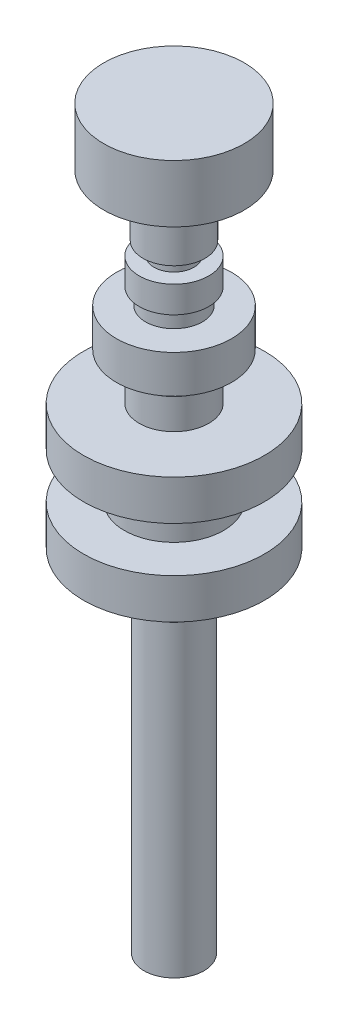
ISO-10303-21;
HEADER;
FILE_DESCRIPTION(('STEP AP214'),'2;1');
FILE_NAME('part.step','',(''),(''),'','','');
FILE_SCHEMA(('AUTOMOTIVE_DESIGN { 1 0 10303 214 1 1 1 1 }'));
ENDSEC;
DATA;
#1=APPLICATION_CONTEXT('core data for automotive mechanical design processes');
#2=APPLICATION_PROTOCOL_DEFINITION('international standard','automotive_design',2000,#1);
#3=PRODUCT_CONTEXT('',#1,'mechanical');
#4=PRODUCT('Part','Part','',(#3));
#5=PRODUCT_RELATED_PRODUCT_CATEGORY('part','',(#4));
#6=PRODUCT_DEFINITION_FORMATION('','',#4);
#7=PRODUCT_DEFINITION_CONTEXT('part definition',#1,'design');
#8=PRODUCT_DEFINITION('design','',#6,#7);
#9=PRODUCT_DEFINITION_SHAPE('','',#8);
#10=(LENGTH_UNIT() NAMED_UNIT(*) SI_UNIT(.MILLI.,.METRE.));
#11=(NAMED_UNIT(*) PLANE_ANGLE_UNIT() SI_UNIT($,.RADIAN.));
#12=(NAMED_UNIT(*) SI_UNIT($,.STERADIAN.) SOLID_ANGLE_UNIT());
#13=UNCERTAINTY_MEASURE_WITH_UNIT(LENGTH_MEASURE(1.E-05),#10,'distance_accuracy_value','');
#14=(GEOMETRIC_REPRESENTATION_CONTEXT(3) GLOBAL_UNCERTAINTY_ASSIGNED_CONTEXT((#13)) GLOBAL_UNIT_ASSIGNED_CONTEXT((#10,
#11,#12)) REPRESENTATION_CONTEXT('',''));
#15=CARTESIAN_POINT('',(0.,0.,0.));
#16=DIRECTION('',(0.,0.,1.));
#17=DIRECTION('',(1.,0.,0.));
#18=AXIS2_PLACEMENT_3D('',#15,#16,#17);
#19=CARTESIAN_POINT('',(0.,0.,0.));
#20=DIRECTION('',(0.,-1.,0.));
#21=DIRECTION('',(0.,0.,-1.));
#22=AXIS2_PLACEMENT_3D('',#19,#20,#21);
#23=PLANE('',#22);
#24=CARTESIAN_POINT('',(0.,0.,0.));
#25=DIRECTION('',(0.,-1.,0.));
#26=DIRECTION('',(0.,0.,-1.));
#27=AXIS2_PLACEMENT_3D('',#24,#25,#26);
#28=CIRCLE('',#27,4.75);
#29=CARTESIAN_POINT('',(0.,0.,-4.75));
#30=VERTEX_POINT('',#29);
#31=EDGE_CURVE('E10',#30,#30,#28,.T.);
#32=ORIENTED_EDGE('',*,*,#31,.T.);
#33=EDGE_LOOP('',(#32));
#34=FACE_BOUND('',#33,.T.);
#35=ADVANCED_FACE('F30',(#34),#23,.T.);
#36=CARTESIAN_POINT('',(0.,0.,0.));
#37=DIRECTION('',(0.,-1.,0.));
#38=DIRECTION('',(0.,0.,-1.));
#39=AXIS2_PLACEMENT_3D('',#36,#37,#38);
#40=CYLINDRICAL_SURFACE('',#39,4.75);
#41=CARTESIAN_POINT('',(0.,49.8,0.));
#42=DIRECTION('',(0.,-1.,0.));
#43=DIRECTION('',(0.,0.,-1.));
#44=AXIS2_PLACEMENT_3D('',#41,#42,#43);
#45=CIRCLE('',#44,4.75);
#46=CARTESIAN_POINT('',(0.,49.8,-4.75));
#47=VERTEX_POINT('',#46);
#48=EDGE_CURVE('E36',#47,#47,#45,.T.);
#49=ORIENTED_EDGE('',*,*,#48,.T.);
#50=EDGE_LOOP('',(#49));
#51=FACE_BOUND('',#50,.T.);
#52=ORIENTED_EDGE('',*,*,#31,.F.);
#53=EDGE_LOOP('',(#52));
#54=FACE_BOUND('',#53,.T.);
#55=ADVANCED_FACE('F128',(#51,#54),#40,.T.);
#56=CARTESIAN_POINT('',(4.75,49.8,0.));
#57=DIRECTION('',(0.,-1.,0.));
#58=DIRECTION('',(0.,0.,-1.));
#59=AXIS2_PLACEMENT_3D('',#56,#57,#58);
#60=PLANE('',#59);
#61=CARTESIAN_POINT('',(0.,49.8,0.));
#62=DIRECTION('',(0.,-1.,0.));
#63=DIRECTION('',(0.,0.,-1.));
#64=AXIS2_PLACEMENT_3D('',#61,#62,#63);
#65=CIRCLE('',#64,6.3);
#66=CARTESIAN_POINT('',(0.,49.8,-6.3));
#67=VERTEX_POINT('',#66);
#68=EDGE_CURVE('E40',#67,#67,#65,.T.);
#69=ORIENTED_EDGE('',*,*,#68,.T.);
#70=EDGE_LOOP('',(#69));
#71=FACE_BOUND('',#70,.T.);
#72=ORIENTED_EDGE('',*,*,#48,.F.);
#73=EDGE_LOOP('',(#72));
#74=FACE_BOUND('',#73,.T.);
#75=ADVANCED_FACE('F132',(#71,#74),#60,.T.);
#76=CARTESIAN_POINT('',(0.,0.,0.));
#77=DIRECTION('',(0.,-1.,0.));
#78=DIRECTION('',(0.,0.,-1.));
#79=AXIS2_PLACEMENT_3D('',#76,#77,#78);
#80=CYLINDRICAL_SURFACE('',#79,6.3);
#81=CARTESIAN_POINT('',(0.,55.5,0.));
#82=DIRECTION('',(0.,-1.,0.));
#83=DIRECTION('',(0.,0.,-1.));
#84=AXIS2_PLACEMENT_3D('',#81,#82,#83);
#85=CIRCLE('',#84,6.3);
#86=CARTESIAN_POINT('',(0.,55.5,-6.3));
#87=VERTEX_POINT('',#86);
#88=EDGE_CURVE('E44',#87,#87,#85,.T.);
#89=ORIENTED_EDGE('',*,*,#88,.T.);
#90=EDGE_LOOP('',(#89));
#91=FACE_BOUND('',#90,.T.);
#92=ORIENTED_EDGE('',*,*,#68,.F.);
#93=EDGE_LOOP('',(#92));
#94=FACE_BOUND('',#93,.T.);
#95=ADVANCED_FACE('F136',(#91,#94),#80,.T.);
#96=CARTESIAN_POINT('',(6.3,55.5,0.));
#97=DIRECTION('',(0.,-1.,0.));
#98=DIRECTION('',(0.,0.,-1.));
#99=AXIS2_PLACEMENT_3D('',#96,#97,#98);
#100=PLANE('',#99);
#101=CARTESIAN_POINT('',(0.,55.5,0.));
#102=DIRECTION('',(0.,-1.,0.));
#103=DIRECTION('',(0.,0.,-1.));
#104=AXIS2_PLACEMENT_3D('',#101,#102,#103);
#105=CIRCLE('',#104,14.3);
#106=CARTESIAN_POINT('',(0.,55.5,-14.3));
#107=VERTEX_POINT('',#106);
#108=EDGE_CURVE('E49',#107,#107,#105,.T.);
#109=ORIENTED_EDGE('',*,*,#108,.T.);
#110=EDGE_LOOP('',(#109));
#111=FACE_BOUND('',#110,.T.);
#112=ORIENTED_EDGE('',*,*,#88,.F.);
#113=EDGE_LOOP('',(#112));
#114=FACE_BOUND('',#113,.T.);
#115=ADVANCED_FACE('F143',(#111,#114),#100,.T.);
#116=CARTESIAN_POINT('',(0.,0.,0.));
#117=DIRECTION('',(0.,-1.,0.));
#118=DIRECTION('',(0.,0.,-1.));
#119=AXIS2_PLACEMENT_3D('',#116,#117,#118);
#120=CYLINDRICAL_SURFACE('',#119,14.3);
#121=CARTESIAN_POINT('',(0.,61.85,0.));
#122=DIRECTION('',(0.,-1.,0.));
#123=DIRECTION('',(0.,0.,-1.));
#124=AXIS2_PLACEMENT_3D('',#121,#122,#123);
#125=CIRCLE('',#124,14.3);
#126=CARTESIAN_POINT('',(0.,61.85,-14.3));
#127=VERTEX_POINT('',#126);
#128=EDGE_CURVE('E52',#127,#127,#125,.T.);
#129=ORIENTED_EDGE('',*,*,#128,.T.);
#130=EDGE_LOOP('',(#129));
#131=FACE_BOUND('',#130,.T.);
#132=ORIENTED_EDGE('',*,*,#108,.F.);
#133=EDGE_LOOP('',(#132));
#134=FACE_BOUND('',#133,.T.);
#135=ADVANCED_FACE('F147',(#131,#134),#120,.T.);
#136=CARTESIAN_POINT('',(14.3,61.85,0.));
#137=DIRECTION('',(0.,1.,0.));
#138=DIRECTION('',(0.,0.,1.));
#139=AXIS2_PLACEMENT_3D('',#136,#137,#138);
#140=PLANE('',#139);
#141=CARTESIAN_POINT('',(0.,61.85,0.));
#142=DIRECTION('',(0.,-1.,0.));
#143=DIRECTION('',(0.,0.,-1.));
#144=AXIS2_PLACEMENT_3D('',#141,#142,#143);
#145=CIRCLE('',#144,7.85);
#146=CARTESIAN_POINT('',(0.,61.85,-7.85));
#147=VERTEX_POINT('',#146);
#148=EDGE_CURVE('E55',#147,#147,#145,.T.);
#149=ORIENTED_EDGE('',*,*,#148,.T.);
#150=EDGE_LOOP('',(#149));
#151=FACE_BOUND('',#150,.T.);
#152=ORIENTED_EDGE('',*,*,#128,.F.);
#153=EDGE_LOOP('',(#152));
#154=FACE_BOUND('',#153,.T.);
#155=ADVANCED_FACE('F151',(#151,#154),#140,.T.);
#156=CARTESIAN_POINT('',(0.,0.,0.));
#157=DIRECTION('',(0.,-1.,0.));
#158=DIRECTION('',(0.,0.,-1.));
#159=AXIS2_PLACEMENT_3D('',#156,#157,#158);
#160=CYLINDRICAL_SURFACE('',#159,7.85);
#161=CARTESIAN_POINT('',(0.,69.,0.));
#162=DIRECTION('',(0.,-1.,0.));
#163=DIRECTION('',(0.,0.,-1.));
#164=AXIS2_PLACEMENT_3D('',#161,#162,#163);
#165=CIRCLE('',#164,7.85);
#166=CARTESIAN_POINT('',(0.,69.,-7.85));
#167=VERTEX_POINT('',#166);
#168=EDGE_CURVE('E58',#167,#167,#165,.T.);
#169=ORIENTED_EDGE('',*,*,#168,.T.);
#170=EDGE_LOOP('',(#169));
#171=FACE_BOUND('',#170,.T.);
#172=ORIENTED_EDGE('',*,*,#148,.F.);
#173=EDGE_LOOP('',(#172));
#174=FACE_BOUND('',#173,.T.);
#175=ADVANCED_FACE('F155',(#171,#174),#160,.T.);
#176=CARTESIAN_POINT('',(7.85,69.,0.));
#177=DIRECTION('',(0.,-1.,0.));
#178=DIRECTION('',(0.,0.,-1.));
#179=AXIS2_PLACEMENT_3D('',#176,#177,#178);
#180=PLANE('',#179);
#181=CARTESIAN_POINT('',(0.,69.,0.));
#182=DIRECTION('',(0.,-1.,0.));
#183=DIRECTION('',(0.,0.,-1.));
#184=AXIS2_PLACEMENT_3D('',#181,#182,#183);
#185=CIRCLE('',#184,14.3);
#186=CARTESIAN_POINT('',(0.,69.,-14.3));
#187=VERTEX_POINT('',#186);
#188=EDGE_CURVE('E61',#187,#187,#185,.T.);
#189=ORIENTED_EDGE('',*,*,#188,.T.);
#190=EDGE_LOOP('',(#189));
#191=FACE_BOUND('',#190,.T.);
#192=ORIENTED_EDGE('',*,*,#168,.F.);
#193=EDGE_LOOP('',(#192));
#194=FACE_BOUND('',#193,.T.);
#195=ADVANCED_FACE('F159',(#191,#194),#180,.T.);
#196=CARTESIAN_POINT('',(0.,0.,0.));
#197=DIRECTION('',(0.,-1.,0.));
#198=DIRECTION('',(0.,0.,-1.));
#199=AXIS2_PLACEMENT_3D('',#196,#197,#198);
#200=CYLINDRICAL_SURFACE('',#199,14.3);
#201=CARTESIAN_POINT('',(0.,75.35,0.));
#202=DIRECTION('',(0.,-1.,0.));
#203=DIRECTION('',(0.,0.,-1.));
#204=AXIS2_PLACEMENT_3D('',#201,#202,#203);
#205=CIRCLE('',#204,14.3);
#206=CARTESIAN_POINT('',(0.,75.35,-14.3));
#207=VERTEX_POINT('',#206);
#208=EDGE_CURVE('E64',#207,#207,#205,.T.);
#209=ORIENTED_EDGE('',*,*,#208,.T.);
#210=EDGE_LOOP('',(#209));
#211=FACE_BOUND('',#210,.T.);
#212=ORIENTED_EDGE('',*,*,#188,.F.);
#213=EDGE_LOOP('',(#212));
#214=FACE_BOUND('',#213,.T.);
#215=ADVANCED_FACE('F163',(#211,#214),#200,.T.);
#216=CARTESIAN_POINT('',(14.3,75.35,0.));
#217=DIRECTION('',(0.,1.,0.));
#218=DIRECTION('',(0.,0.,1.));
#219=AXIS2_PLACEMENT_3D('',#216,#217,#218);
#220=PLANE('',#219);
#221=CARTESIAN_POINT('',(0.,75.35,0.));
#222=DIRECTION('',(0.,-1.,0.));
#223=DIRECTION('',(0.,0.,-1.));
#224=AXIS2_PLACEMENT_3D('',#221,#222,#223);
#225=CIRCLE('',#224,5.50000000000001);
#226=CARTESIAN_POINT('',(0.,75.35,-5.50000000000001));
#227=VERTEX_POINT('',#226);
#228=EDGE_CURVE('E67',#227,#227,#225,.T.);
#229=ORIENTED_EDGE('',*,*,#228,.T.);
#230=EDGE_LOOP('',(#229));
#231=FACE_BOUND('',#230,.T.);
#232=ORIENTED_EDGE('',*,*,#208,.F.);
#233=EDGE_LOOP('',(#232));
#234=FACE_BOUND('',#233,.T.);
#235=ADVANCED_FACE('F167',(#231,#234),#220,.T.);
#236=CARTESIAN_POINT('',(0.,0.,0.));
#237=DIRECTION('',(0.,-1.,0.));
#238=DIRECTION('',(0.,0.,-1.));
#239=AXIS2_PLACEMENT_3D('',#236,#237,#238);
#240=CYLINDRICAL_SURFACE('',#239,5.50000000000001);
#241=CARTESIAN_POINT('',(0.,80.15,0.));
#242=DIRECTION('',(0.,-1.,0.));
#243=DIRECTION('',(0.,0.,-1.));
#244=AXIS2_PLACEMENT_3D('',#241,#242,#243);
#245=CIRCLE('',#244,5.50000000000001);
#246=CARTESIAN_POINT('',(0.,80.15,-5.50000000000001));
#247=VERTEX_POINT('',#246);
#248=EDGE_CURVE('E70',#247,#247,#245,.T.);
#249=ORIENTED_EDGE('',*,*,#248,.T.);
#250=EDGE_LOOP('',(#249));
#251=FACE_BOUND('',#250,.T.);
#252=ORIENTED_EDGE('',*,*,#228,.F.);
#253=EDGE_LOOP('',(#252));
#254=FACE_BOUND('',#253,.T.);
#255=ADVANCED_FACE('F171',(#251,#254),#240,.T.);
#256=CARTESIAN_POINT('',(5.50000000000001,80.15,0.));
#257=DIRECTION('',(0.,1.,0.));
#258=DIRECTION('',(0.,0.,1.));
#259=AXIS2_PLACEMENT_3D('',#256,#257,#258);
#260=PLANE('',#259);
#261=CARTESIAN_POINT('',(0.,80.15,0.));
#262=DIRECTION('',(0.,-1.,0.));
#263=DIRECTION('',(0.,0.,-1.));
#264=AXIS2_PLACEMENT_3D('',#261,#262,#263);
#265=CIRCLE('',#264,4.5);
#266=CARTESIAN_POINT('',(0.,80.15,-4.5));
#267=VERTEX_POINT('',#266);
#268=EDGE_CURVE('E73',#267,#267,#265,.T.);
#269=ORIENTED_EDGE('',*,*,#268,.T.);
#270=EDGE_LOOP('',(#269));
#271=FACE_BOUND('',#270,.T.);
#272=ORIENTED_EDGE('',*,*,#248,.F.);
#273=EDGE_LOOP('',(#272));
#274=FACE_BOUND('',#273,.T.);
#275=ADVANCED_FACE('F175',(#271,#274),#260,.T.);
#276=CARTESIAN_POINT('',(0.,0.,0.));
#277=DIRECTION('',(0.,-1.,0.));
#278=DIRECTION('',(0.,0.,-1.));
#279=AXIS2_PLACEMENT_3D('',#276,#277,#278);
#280=CYLINDRICAL_SURFACE('',#279,4.5);
#281=CARTESIAN_POINT('',(0.,82.75,0.));
#282=DIRECTION('',(0.,-1.,0.));
#283=DIRECTION('',(0.,0.,-1.));
#284=AXIS2_PLACEMENT_3D('',#281,#282,#283);
#285=CIRCLE('',#284,4.5);
#286=CARTESIAN_POINT('',(0.,82.75,-4.5));
#287=VERTEX_POINT('',#286);
#288=EDGE_CURVE('E76',#287,#287,#285,.T.);
#289=ORIENTED_EDGE('',*,*,#288,.T.);
#290=EDGE_LOOP('',(#289));
#291=FACE_BOUND('',#290,.T.);
#292=ORIENTED_EDGE('',*,*,#268,.F.);
#293=EDGE_LOOP('',(#292));
#294=FACE_BOUND('',#293,.T.);
#295=ADVANCED_FACE('F179',(#291,#294),#280,.T.);
#296=CARTESIAN_POINT('',(4.5,82.75,0.));
#297=DIRECTION('',(0.,-1.,0.));
#298=DIRECTION('',(0.,0.,-1.));
#299=AXIS2_PLACEMENT_3D('',#296,#297,#298);
#300=PLANE('',#299);
#301=CARTESIAN_POINT('',(0.,82.75,0.));
#302=DIRECTION('',(0.,-1.,0.));
#303=DIRECTION('',(0.,0.,-1.));
#304=AXIS2_PLACEMENT_3D('',#301,#302,#303);
#305=CIRCLE('',#304,9.1);
#306=CARTESIAN_POINT('',(0.,82.75,-9.1));
#307=VERTEX_POINT('',#306);
#308=EDGE_CURVE('E79',#307,#307,#305,.T.);
#309=ORIENTED_EDGE('',*,*,#308,.T.);
#310=EDGE_LOOP('',(#309));
#311=FACE_BOUND('',#310,.T.);
#312=ORIENTED_EDGE('',*,*,#288,.F.);
#313=EDGE_LOOP('',(#312));
#314=FACE_BOUND('',#313,.T.);
#315=ADVANCED_FACE('F183',(#311,#314),#300,.T.);
#316=CARTESIAN_POINT('',(0.,0.,0.));
#317=DIRECTION('',(0.,-1.,0.));
#318=DIRECTION('',(0.,0.,-1.));
#319=AXIS2_PLACEMENT_3D('',#316,#317,#318);
#320=CYLINDRICAL_SURFACE('',#319,9.1);
#321=CARTESIAN_POINT('',(0.,88.75,0.));
#322=DIRECTION('',(0.,-1.,0.));
#323=DIRECTION('',(0.,0.,-1.));
#324=AXIS2_PLACEMENT_3D('',#321,#322,#323);
#325=CIRCLE('',#324,9.1);
#326=CARTESIAN_POINT('',(0.,88.75,-9.1));
#327=VERTEX_POINT('',#326);
#328=EDGE_CURVE('E82',#327,#327,#325,.T.);
#329=ORIENTED_EDGE('',*,*,#328,.T.);
#330=EDGE_LOOP('',(#329));
#331=FACE_BOUND('',#330,.T.);
#332=ORIENTED_EDGE('',*,*,#308,.F.);
#333=EDGE_LOOP('',(#332));
#334=FACE_BOUND('',#333,.T.);
#335=ADVANCED_FACE('F187',(#331,#334),#320,.T.);
#336=CARTESIAN_POINT('',(9.1,88.75,0.));
#337=DIRECTION('',(0.,1.,0.));
#338=DIRECTION('',(0.,0.,1.));
#339=AXIS2_PLACEMENT_3D('',#336,#337,#338);
#340=PLANE('',#339);
#341=CARTESIAN_POINT('',(0.,88.75,0.));
#342=DIRECTION('',(0.,-1.,0.));
#343=DIRECTION('',(0.,0.,-1.));
#344=AXIS2_PLACEMENT_3D('',#341,#342,#343);
#345=CIRCLE('',#344,4.50000000000001);
#346=CARTESIAN_POINT('',(0.,88.75,-4.50000000000001));
#347=VERTEX_POINT('',#346);
#348=EDGE_CURVE('E85',#347,#347,#345,.T.);
#349=ORIENTED_EDGE('',*,*,#348,.T.);
#350=EDGE_LOOP('',(#349));
#351=FACE_BOUND('',#350,.T.);
#352=ORIENTED_EDGE('',*,*,#328,.F.);
#353=EDGE_LOOP('',(#352));
#354=FACE_BOUND('',#353,.T.);
#355=ADVANCED_FACE('F191',(#351,#354),#340,.T.);
#356=CARTESIAN_POINT('',(0.,0.,0.));
#357=DIRECTION('',(0.,-1.,0.));
#358=DIRECTION('',(0.,0.,-1.));
#359=AXIS2_PLACEMENT_3D('',#356,#357,#358);
#360=CYLINDRICAL_SURFACE('',#359,4.50000000000001);
#361=CARTESIAN_POINT('',(0.,91.35,0.));
#362=DIRECTION('',(0.,-1.,0.));
#363=DIRECTION('',(0.,0.,-1.));
#364=AXIS2_PLACEMENT_3D('',#361,#362,#363);
#365=CIRCLE('',#364,4.50000000000001);
#366=CARTESIAN_POINT('',(0.,91.35,-4.50000000000001));
#367=VERTEX_POINT('',#366);
#368=EDGE_CURVE('E88',#367,#367,#365,.T.);
#369=ORIENTED_EDGE('',*,*,#368,.T.);
#370=EDGE_LOOP('',(#369));
#371=FACE_BOUND('',#370,.T.);
#372=ORIENTED_EDGE('',*,*,#348,.F.);
#373=EDGE_LOOP('',(#372));
#374=FACE_BOUND('',#373,.T.);
#375=ADVANCED_FACE('F195',(#371,#374),#360,.T.);
#376=CARTESIAN_POINT('',(4.50000000000001,91.35,0.));
#377=DIRECTION('',(0.,-1.,0.));
#378=DIRECTION('',(0.,0.,-1.));
#379=AXIS2_PLACEMENT_3D('',#376,#377,#378);
#380=PLANE('',#379);
#381=CARTESIAN_POINT('',(0.,91.35,0.));
#382=DIRECTION('',(0.,-1.,0.));
#383=DIRECTION('',(0.,0.,-1.));
#384=AXIS2_PLACEMENT_3D('',#381,#382,#383);
#385=CIRCLE('',#384,5.50000000000001);
#386=CARTESIAN_POINT('',(0.,91.35,-5.50000000000001));
#387=VERTEX_POINT('',#386);
#388=EDGE_CURVE('E91',#387,#387,#385,.T.);
#389=ORIENTED_EDGE('',*,*,#388,.T.);
#390=EDGE_LOOP('',(#389));
#391=FACE_BOUND('',#390,.T.);
#392=ORIENTED_EDGE('',*,*,#368,.F.);
#393=EDGE_LOOP('',(#392));
#394=FACE_BOUND('',#393,.T.);
#395=ADVANCED_FACE('F199',(#391,#394),#380,.T.);
#396=CARTESIAN_POINT('',(0.,0.,0.));
#397=DIRECTION('',(0.,-1.,0.));
#398=DIRECTION('',(0.,0.,-1.));
#399=AXIS2_PLACEMENT_3D('',#396,#397,#398);
#400=CYLINDRICAL_SURFACE('',#399,5.50000000000001);
#401=CARTESIAN_POINT('',(0.,95.55,0.));
#402=DIRECTION('',(0.,-1.,0.));
#403=DIRECTION('',(0.,0.,-1.));
#404=AXIS2_PLACEMENT_3D('',#401,#402,#403);
#405=CIRCLE('',#404,5.50000000000001);
#406=CARTESIAN_POINT('',(0.,95.55,-5.50000000000001));
#407=VERTEX_POINT('',#406);
#408=EDGE_CURVE('E94',#407,#407,#405,.T.);
#409=ORIENTED_EDGE('',*,*,#408,.T.);
#410=EDGE_LOOP('',(#409));
#411=FACE_BOUND('',#410,.T.);
#412=ORIENTED_EDGE('',*,*,#388,.F.);
#413=EDGE_LOOP('',(#412));
#414=FACE_BOUND('',#413,.T.);
#415=ADVANCED_FACE('F203',(#411,#414),#400,.T.);
#416=CARTESIAN_POINT('',(5.50000000000001,95.55,0.));
#417=DIRECTION('',(0.,1.,0.));
#418=DIRECTION('',(0.,0.,1.));
#419=AXIS2_PLACEMENT_3D('',#416,#417,#418);
#420=PLANE('',#419);
#421=CARTESIAN_POINT('',(0.,95.55,0.));
#422=DIRECTION('',(0.,-1.,0.));
#423=DIRECTION('',(0.,0.,-1.));
#424=AXIS2_PLACEMENT_3D('',#421,#422,#423);
#425=CIRCLE('',#424,3.15000000000001);
#426=CARTESIAN_POINT('',(0.,95.55,-3.15000000000001));
#427=VERTEX_POINT('',#426);
#428=EDGE_CURVE('E97',#427,#427,#425,.T.);
#429=ORIENTED_EDGE('',*,*,#428,.T.);
#430=EDGE_LOOP('',(#429));
#431=FACE_BOUND('',#430,.T.);
#432=ORIENTED_EDGE('',*,*,#408,.F.);
#433=EDGE_LOOP('',(#432));
#434=FACE_BOUND('',#433,.T.);
#435=ADVANCED_FACE('F207',(#431,#434),#420,.T.);
#436=CARTESIAN_POINT('',(0.,0.,0.));
#437=DIRECTION('',(0.,-1.,0.));
#438=DIRECTION('',(0.,0.,-1.));
#439=AXIS2_PLACEMENT_3D('',#436,#437,#438);
#440=CYLINDRICAL_SURFACE('',#439,3.15000000000001);
#441=CARTESIAN_POINT('',(0.,97.65,0.));
#442=DIRECTION('',(0.,-1.,0.));
#443=DIRECTION('',(0.,0.,-1.));
#444=AXIS2_PLACEMENT_3D('',#441,#442,#443);
#445=CIRCLE('',#444,3.15000000000001);
#446=CARTESIAN_POINT('',(0.,97.65,-3.15000000000001));
#447=VERTEX_POINT('',#446);
#448=EDGE_CURVE('E100',#447,#447,#445,.T.);
#449=ORIENTED_EDGE('',*,*,#448,.T.);
#450=EDGE_LOOP('',(#449));
#451=FACE_BOUND('',#450,.T.);
#452=ORIENTED_EDGE('',*,*,#428,.F.);
#453=EDGE_LOOP('',(#452));
#454=FACE_BOUND('',#453,.T.);
#455=ADVANCED_FACE('F211',(#451,#454),#440,.T.);
#456=CARTESIAN_POINT('',(3.15000000000001,97.65,0.));
#457=DIRECTION('',(0.,-1.,0.));
#458=DIRECTION('',(0.,0.,-1.));
#459=AXIS2_PLACEMENT_3D('',#456,#457,#458);
#460=PLANE('',#459);
#461=CARTESIAN_POINT('',(0.,97.65,0.));
#462=DIRECTION('',(0.,-1.,0.));
#463=DIRECTION('',(0.,0.,-1.));
#464=AXIS2_PLACEMENT_3D('',#461,#462,#463);
#465=CIRCLE('',#464,4.9);
#466=CARTESIAN_POINT('',(0.,97.65,-4.9));
#467=VERTEX_POINT('',#466);
#468=EDGE_CURVE('E103',#467,#467,#465,.T.);
#469=ORIENTED_EDGE('',*,*,#468,.T.);
#470=EDGE_LOOP('',(#469));
#471=FACE_BOUND('',#470,.T.);
#472=ORIENTED_EDGE('',*,*,#448,.F.);
#473=EDGE_LOOP('',(#472));
#474=FACE_BOUND('',#473,.T.);
#475=ADVANCED_FACE('F215',(#471,#474),#460,.T.);
#476=CARTESIAN_POINT('',(0.,0.,0.));
#477=DIRECTION('',(0.,-1.,0.));
#478=DIRECTION('',(0.,0.,-1.));
#479=AXIS2_PLACEMENT_3D('',#476,#477,#478);
#480=CYLINDRICAL_SURFACE('',#479,4.9);
#481=CARTESIAN_POINT('',(0.,107.35,0.));
#482=DIRECTION('',(0.,-1.,0.));
#483=DIRECTION('',(0.,0.,-1.));
#484=AXIS2_PLACEMENT_3D('',#481,#482,#483);
#485=CIRCLE('',#484,4.9);
#486=CARTESIAN_POINT('',(0.,107.35,-4.9));
#487=VERTEX_POINT('',#486);
#488=EDGE_CURVE('E106',#487,#487,#485,.T.);
#489=ORIENTED_EDGE('',*,*,#488,.T.);
#490=EDGE_LOOP('',(#489));
#491=FACE_BOUND('',#490,.T.);
#492=ORIENTED_EDGE('',*,*,#468,.F.);
#493=EDGE_LOOP('',(#492));
#494=FACE_BOUND('',#493,.T.);
#495=ADVANCED_FACE('F219',(#491,#494),#480,.T.);
#496=CARTESIAN_POINT('',(4.9,107.35,0.));
#497=DIRECTION('',(0.,-1.,0.));
#498=DIRECTION('',(0.,0.,-1.));
#499=AXIS2_PLACEMENT_3D('',#496,#497,#498);
#500=PLANE('',#499);
#501=CARTESIAN_POINT('',(0.,107.35,0.));
#502=DIRECTION('',(0.,-1.,0.));
#503=DIRECTION('',(0.,0.,-1.));
#504=AXIS2_PLACEMENT_3D('',#501,#502,#503);
#505=CIRCLE('',#504,11.1);
#506=CARTESIAN_POINT('',(0.,107.35,-11.1));
#507=VERTEX_POINT('',#506);
#508=EDGE_CURVE('E109',#507,#507,#505,.T.);
#509=ORIENTED_EDGE('',*,*,#508,.T.);
#510=EDGE_LOOP('',(#509));
#511=FACE_BOUND('',#510,.T.);
#512=ORIENTED_EDGE('',*,*,#488,.F.);
#513=EDGE_LOOP('',(#512));
#514=FACE_BOUND('',#513,.T.);
#515=ADVANCED_FACE('F125',(#511,#514),#500,.T.);
#516=CARTESIAN_POINT('',(0.,0.,0.));
#517=DIRECTION('',(0.,-1.,0.));
#518=DIRECTION('',(0.,0.,-1.));
#519=AXIS2_PLACEMENT_3D('',#516,#517,#518);
#520=CYLINDRICAL_SURFACE('',#519,11.1);
#521=CARTESIAN_POINT('',(0.,116.45,0.));
#522=DIRECTION('',(0.,-1.,0.));
#523=DIRECTION('',(0.,0.,-1.));
#524=AXIS2_PLACEMENT_3D('',#521,#522,#523);
#525=CIRCLE('',#524,11.1);
#526=CARTESIAN_POINT('',(0.,116.45,-11.1));
#527=VERTEX_POINT('',#526);
#528=EDGE_CURVE('E112',#527,#527,#525,.T.);
#529=ORIENTED_EDGE('',*,*,#528,.T.);
#530=EDGE_LOOP('',(#529));
#531=FACE_BOUND('',#530,.T.);
#532=ORIENTED_EDGE('',*,*,#508,.F.);
#533=EDGE_LOOP('',(#532));
#534=FACE_BOUND('',#533,.T.);
#535=ADVANCED_FACE('F116',(#531,#534),#520,.T.);
#536=CARTESIAN_POINT('',(11.1,116.45,0.));
#537=DIRECTION('',(0.,1.,0.));
#538=DIRECTION('',(0.,0.,1.));
#539=AXIS2_PLACEMENT_3D('',#536,#537,#538);
#540=PLANE('',#539);
#541=ORIENTED_EDGE('',*,*,#528,.F.);
#542=EDGE_LOOP('',(#541));
#543=FACE_BOUND('',#542,.T.);
#544=ADVANCED_FACE('F119',(#543),#540,.T.);
#545=CLOSED_SHELL('',(#35,#55,#75,#95,#115,#135,#155,#175,#195,#215,#235,#255,#275,#295,#315,
#335,#355,#375,#395,#415,#435,#455,#475,#495,#515,#535,#544));
#546=MANIFOLD_SOLID_BREP('B2',#545);
#547=ADVANCED_BREP_SHAPE_REPRESENTATION('',(#18,#546),#14);
#548=SHAPE_DEFINITION_REPRESENTATION(#9,#547);
ENDSEC;
END-ISO-10303-21;
